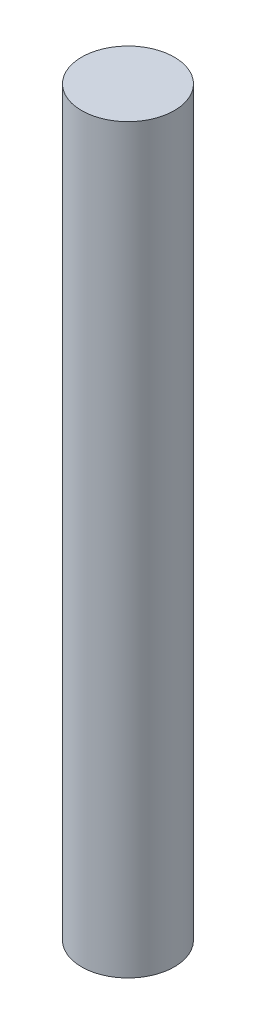
ISO-10303-21;
HEADER;
FILE_DESCRIPTION(('STEP AP214'),'2;1');
FILE_NAME('part.step','',(''),(''),'','','');
FILE_SCHEMA(('AUTOMOTIVE_DESIGN { 1 0 10303 214 1 1 1 1 }'));
ENDSEC;
DATA;
#1=APPLICATION_CONTEXT('core data for automotive mechanical design processes');
#2=APPLICATION_PROTOCOL_DEFINITION('international standard','automotive_design',2000,#1);
#3=PRODUCT_CONTEXT('',#1,'mechanical');
#4=PRODUCT('Part','Part','',(#3));
#5=PRODUCT_RELATED_PRODUCT_CATEGORY('part','',(#4));
#6=PRODUCT_DEFINITION_FORMATION('','',#4);
#7=PRODUCT_DEFINITION_CONTEXT('part definition',#1,'design');
#8=PRODUCT_DEFINITION('design','',#6,#7);
#9=PRODUCT_DEFINITION_SHAPE('','',#8);
#10=(LENGTH_UNIT() NAMED_UNIT(*) SI_UNIT(.MILLI.,.METRE.));
#11=(NAMED_UNIT(*) PLANE_ANGLE_UNIT() SI_UNIT($,.RADIAN.));
#12=(NAMED_UNIT(*) SI_UNIT($,.STERADIAN.) SOLID_ANGLE_UNIT());
#13=UNCERTAINTY_MEASURE_WITH_UNIT(LENGTH_MEASURE(1.E-05),#10,'distance_accuracy_value','');
#14=(GEOMETRIC_REPRESENTATION_CONTEXT(3) GLOBAL_UNCERTAINTY_ASSIGNED_CONTEXT((#13)) GLOBAL_UNIT_ASSIGNED_CONTEXT((#10,
#11,#12)) REPRESENTATION_CONTEXT('',''));
#15=CARTESIAN_POINT('',(0.,0.,0.));
#16=DIRECTION('',(0.,0.,1.));
#17=DIRECTION('',(1.,0.,0.));
#18=AXIS2_PLACEMENT_3D('',#15,#16,#17);
#19=CARTESIAN_POINT('',(0.,25.4,0.));
#20=DIRECTION('',(0.,-1.,0.));
#21=DIRECTION('',(0.,0.,-1.));
#22=AXIS2_PLACEMENT_3D('',#19,#20,#21);
#23=CYLINDRICAL_SURFACE('',#22,1.5875);
#24=CARTESIAN_POINT('',(0.,25.4,0.));
#25=DIRECTION('',(0.,1.,0.));
#26=DIRECTION('',(0.,0.,1.));
#27=AXIS2_PLACEMENT_3D('',#24,#25,#26);
#28=CIRCLE('',#27,1.5875);
#29=CARTESIAN_POINT('',(0.,25.4,1.5875));
#30=VERTEX_POINT('',#29);
#31=EDGE_CURVE('E10',#30,#30,#28,.T.);
#32=ORIENTED_EDGE('',*,*,#31,.F.);
#33=EDGE_LOOP('',(#32));
#34=FACE_BOUND('',#33,.T.);
#35=CARTESIAN_POINT('',(0.,0.,0.));
#36=DIRECTION('',(0.,1.,0.));
#37=DIRECTION('',(0.,0.,1.));
#38=AXIS2_PLACEMENT_3D('',#35,#36,#37);
#39=CIRCLE('',#38,1.5875);
#40=CARTESIAN_POINT('',(0.,0.,1.5875));
#41=VERTEX_POINT('',#40);
#42=EDGE_CURVE('E40',#41,#41,#39,.T.);
#43=ORIENTED_EDGE('',*,*,#42,.T.);
#44=EDGE_LOOP('',(#43));
#45=FACE_BOUND('',#44,.T.);
#46=ADVANCED_FACE('F37',(#34,#45),#23,.T.);
#47=CARTESIAN_POINT('',(0.,25.4,0.));
#48=DIRECTION('',(0.,1.,0.));
#49=DIRECTION('',(0.,0.,1.));
#50=AXIS2_PLACEMENT_3D('',#47,#48,#49);
#51=PLANE('',#50);
#52=ORIENTED_EDGE('',*,*,#31,.T.);
#53=EDGE_LOOP('',(#52));
#54=FACE_BOUND('',#53,.T.);
#55=ADVANCED_FACE('F54',(#54),#51,.T.);
#56=CARTESIAN_POINT('',(0.,0.,0.));
#57=DIRECTION('',(0.,1.,0.));
#58=DIRECTION('',(0.,0.,1.));
#59=AXIS2_PLACEMENT_3D('',#56,#57,#58);
#60=PLANE('',#59);
#61=ORIENTED_EDGE('',*,*,#42,.F.);
#62=EDGE_LOOP('',(#61));
#63=FACE_BOUND('',#62,.T.);
#64=ADVANCED_FACE('F52',(#63),#60,.F.);
#65=CLOSED_SHELL('',(#46,#55,#64));
#66=MANIFOLD_SOLID_BREP('B2',#65);
#67=ADVANCED_BREP_SHAPE_REPRESENTATION('',(#18,#66),#14);
#68=SHAPE_DEFINITION_REPRESENTATION(#9,#67);
ENDSEC;
END-ISO-10303-21;
